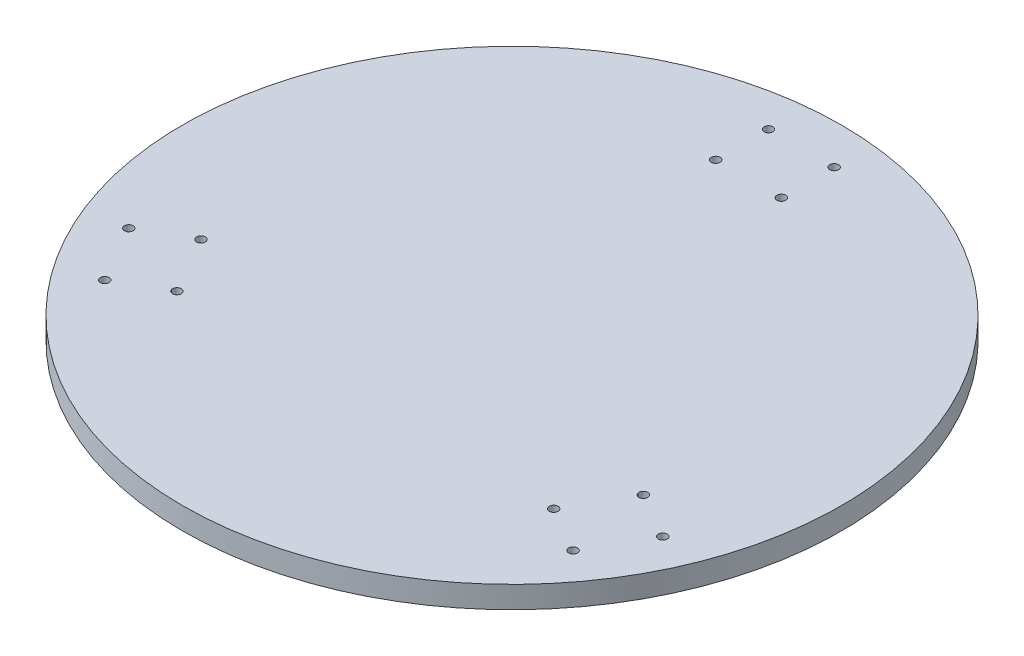
ISO-10303-21;
HEADER;
FILE_DESCRIPTION(('STEP AP214'),'2;1');
FILE_NAME('part.step','',(''),(''),'','','');
FILE_SCHEMA(('AUTOMOTIVE_DESIGN { 1 0 10303 214 1 1 1 1 }'));
ENDSEC;
DATA;
#1=APPLICATION_CONTEXT('core data for automotive mechanical design processes');
#2=APPLICATION_PROTOCOL_DEFINITION('international standard','automotive_design',2000,#1);
#3=PRODUCT_CONTEXT('',#1,'mechanical');
#4=PRODUCT('Part','Part','',(#3));
#5=PRODUCT_RELATED_PRODUCT_CATEGORY('part','',(#4));
#6=PRODUCT_DEFINITION_FORMATION('','',#4);
#7=PRODUCT_DEFINITION_CONTEXT('part definition',#1,'design');
#8=PRODUCT_DEFINITION('design','',#6,#7);
#9=PRODUCT_DEFINITION_SHAPE('','',#8);
#10=(LENGTH_UNIT() NAMED_UNIT(*) SI_UNIT(.MILLI.,.METRE.));
#11=(NAMED_UNIT(*) PLANE_ANGLE_UNIT() SI_UNIT($,.RADIAN.));
#12=(NAMED_UNIT(*) SI_UNIT($,.STERADIAN.) SOLID_ANGLE_UNIT());
#13=UNCERTAINTY_MEASURE_WITH_UNIT(LENGTH_MEASURE(1.E-05),#10,'distance_accuracy_value','');
#14=(GEOMETRIC_REPRESENTATION_CONTEXT(3) GLOBAL_UNCERTAINTY_ASSIGNED_CONTEXT((#13)) GLOBAL_UNIT_ASSIGNED_CONTEXT((#10,
#11,#12)) REPRESENTATION_CONTEXT('',''));
#15=CARTESIAN_POINT('',(0.,0.,0.));
#16=DIRECTION('',(0.,0.,1.));
#17=DIRECTION('',(1.,0.,0.));
#18=AXIS2_PLACEMENT_3D('',#15,#16,#17);
#19=CARTESIAN_POINT('',(0.,10.,0.));
#20=DIRECTION('',(0.,-1.,0.));
#21=DIRECTION('',(0.,0.,-1.));
#22=AXIS2_PLACEMENT_3D('',#19,#20,#21);
#23=CYLINDRICAL_SURFACE('',#22,150.);
#24=CARTESIAN_POINT('',(0.,10.,0.));
#25=DIRECTION('',(0.,1.,0.));
#26=DIRECTION('',(0.,0.,1.));
#27=AXIS2_PLACEMENT_3D('',#24,#25,#26);
#28=CIRCLE('',#27,150.);
#29=CARTESIAN_POINT('',(0.,10.,150.));
#30=VERTEX_POINT('',#29);
#31=EDGE_CURVE('E10',#30,#30,#28,.T.);
#32=ORIENTED_EDGE('',*,*,#31,.F.);
#33=EDGE_LOOP('',(#32));
#34=FACE_BOUND('',#33,.T.);
#35=CARTESIAN_POINT('',(0.,0.,0.));
#36=DIRECTION('',(0.,1.,0.));
#37=DIRECTION('',(0.,0.,1.));
#38=AXIS2_PLACEMENT_3D('',#35,#36,#37);
#39=CIRCLE('',#38,150.);
#40=CARTESIAN_POINT('',(0.,0.,150.));
#41=VERTEX_POINT('',#40);
#42=EDGE_CURVE('E44',#41,#41,#39,.T.);
#43=ORIENTED_EDGE('',*,*,#42,.T.);
#44=EDGE_LOOP('',(#43));
#45=FACE_BOUND('',#44,.T.);
#46=ADVANCED_FACE('F41',(#34,#45),#23,.T.);
#47=CARTESIAN_POINT('',(0.,10.,0.));
#48=DIRECTION('',(0.,1.,0.));
#49=DIRECTION('',(0.,0.,1.));
#50=AXIS2_PLACEMENT_3D('',#47,#48,#49);
#51=PLANE('',#50);
#52=CARTESIAN_POINT('',(-106.588625041321,10.,78.7959709062652));
#53=DIRECTION('',(0.,1.,0.));
#54=DIRECTION('',(0.,0.,1.));
#55=AXIS2_PLACEMENT_3D('',#52,#53,#54);
#56=CIRCLE('',#55,2.0000000000276);
#57=CARTESIAN_POINT('',(-106.588625041321,10.,80.7959709062928));
#58=VERTEX_POINT('',#57);
#59=EDGE_CURVE('E99',#58,#58,#56,.T.);
#60=ORIENTED_EDGE('',*,*,#59,.F.);
#61=EDGE_LOOP('',(#60));
#62=FACE_BOUND('',#61,.T.);
#63=CARTESIAN_POINT('',(106.588625041366,10.,78.7959709062389));
#64=DIRECTION('',(0.,1.,0.));
#65=DIRECTION('',(0.,0.,-1.));
#66=AXIS2_PLACEMENT_3D('',#63,#64,#65);
#67=CIRCLE('',#66,2.00000000001479);
#68=CARTESIAN_POINT('',(106.588625041366,10.,76.7959709062241));
#69=VERTEX_POINT('',#68);
#70=EDGE_CURVE('E108',#69,#69,#67,.T.);
#71=ORIENTED_EDGE('',*,*,#70,.F.);
#72=EDGE_LOOP('',(#71));
#73=FACE_BOUND('',#72,.T.);
#74=CARTESIAN_POINT('',(85.7520538263128,10.,66.7659709062389));
#75=DIRECTION('',(0.,1.,0.));
#76=DIRECTION('',(0.,0.,-1.));
#77=AXIS2_PLACEMENT_3D('',#74,#75,#76);
#78=CIRCLE('',#77,2.00000000001484);
#79=CARTESIAN_POINT('',(85.7520538263128,10.,64.7659709062241));
#80=VERTEX_POINT('',#79);
#81=EDGE_CURVE('E116',#80,#80,#78,.T.);
#82=ORIENTED_EDGE('',*,*,#81,.F.);
#83=EDGE_LOOP('',(#82));
#84=FACE_BOUND('',#83,.T.);
#85=CARTESIAN_POINT('',(100.697053826313,10.,40.880471587122));
#86=DIRECTION('',(0.,1.,0.));
#87=DIRECTION('',(0.,0.,1.));
#88=AXIS2_PLACEMENT_3D('',#85,#86,#87);
#89=CIRCLE('',#88,2.00000000001555);
#90=CARTESIAN_POINT('',(100.697053826313,10.,42.8804715871376));
#91=VERTEX_POINT('',#90);
#92=EDGE_CURVE('E84',#91,#91,#89,.T.);
#93=ORIENTED_EDGE('',*,*,#92,.F.);
#94=EDGE_LOOP('',(#93));
#95=FACE_BOUND('',#94,.T.);
#96=CARTESIAN_POINT('',(-14.945,10.,-107.646442493381));
#97=DIRECTION('',(0.,1.,0.));
#98=DIRECTION('',(0.,0.,1.));
#99=AXIS2_PLACEMENT_3D('',#96,#97,#98);
#100=CIRCLE('',#99,2.);
#101=CARTESIAN_POINT('',(-14.945,10.,-105.646442493381));
#102=VERTEX_POINT('',#101);
#103=EDGE_CURVE('E59',#102,#102,#100,.T.);
#104=ORIENTED_EDGE('',*,*,#103,.F.);
#105=EDGE_LOOP('',(#104));
#106=FACE_BOUND('',#105,.T.);
#107=CARTESIAN_POINT('',(14.9449999999993,10.,-107.646442493381));
#108=DIRECTION('',(0.,1.,0.));
#109=DIRECTION('',(0.,0.,-1.));
#110=AXIS2_PLACEMENT_3D('',#107,#108,#109);
#111=CIRCLE('',#110,2.);
#112=CARTESIAN_POINT('',(14.9449999999993,10.,-109.646442493381));
#113=VERTEX_POINT('',#112);
#114=EDGE_CURVE('E67',#113,#113,#111,.T.);
#115=ORIENTED_EDGE('',*,*,#114,.F.);
#116=EDGE_LOOP('',(#115));
#117=FACE_BOUND('',#116,.T.);
#118=CARTESIAN_POINT('',(14.9449999999991,10.,-131.706442493381));
#119=DIRECTION('',(0.,1.,0.));
#120=DIRECTION('',(0.,0.,-1.));
#121=AXIS2_PLACEMENT_3D('',#118,#119,#120);
#122=CIRCLE('',#121,2.);
#123=CARTESIAN_POINT('',(14.9449999999991,10.,-133.706442493381));
#124=VERTEX_POINT('',#123);
#125=EDGE_CURVE('E68',#124,#124,#122,.T.);
#126=ORIENTED_EDGE('',*,*,#125,.F.);
#127=EDGE_LOOP('',(#126));
#128=FACE_BOUND('',#127,.T.);
#129=CARTESIAN_POINT('',(121.533625041366,10.,52.910471587122));
#130=DIRECTION('',(0.,1.,0.));
#131=DIRECTION('',(0.,0.,1.));
#132=AXIS2_PLACEMENT_3D('',#129,#130,#131);
#133=CIRCLE('',#132,2.00000000001566);
#134=CARTESIAN_POINT('',(121.533625041366,10.,54.9104715871377));
#135=VERTEX_POINT('',#134);
#136=EDGE_CURVE('E83',#135,#135,#133,.T.);
#137=ORIENTED_EDGE('',*,*,#136,.F.);
#138=EDGE_LOOP('',(#137));
#139=FACE_BOUND('',#138,.T.);
#140=CARTESIAN_POINT('',(-85.7520538262674,10.,66.7659709062652));
#141=DIRECTION('',(0.,1.,0.));
#142=DIRECTION('',(0.,0.,1.));
#143=AXIS2_PLACEMENT_3D('',#140,#141,#142);
#144=CIRCLE('',#143,2.00000000002738);
#145=CARTESIAN_POINT('',(-85.7520538262674,10.,68.7659709062925));
#146=VERTEX_POINT('',#145);
#147=EDGE_CURVE('E100',#146,#146,#144,.T.);
#148=ORIENTED_EDGE('',*,*,#147,.F.);
#149=EDGE_LOOP('',(#148));
#150=FACE_BOUND('',#149,.T.);
#151=CARTESIAN_POINT('',(-100.697053826267,10.,40.8804715871483));
#152=DIRECTION('',(0.,1.,0.));
#153=DIRECTION('',(0.,0.,-1.));
#154=AXIS2_PLACEMENT_3D('',#151,#152,#153);
#155=CIRCLE('',#154,2.0000000000266);
#156=CARTESIAN_POINT('',(-100.697053826267,10.,38.8804715871217));
#157=VERTEX_POINT('',#156);
#158=EDGE_CURVE('E139',#157,#157,#155,.T.);
#159=ORIENTED_EDGE('',*,*,#158,.F.);
#160=EDGE_LOOP('',(#159));
#161=FACE_BOUND('',#160,.T.);
#162=CARTESIAN_POINT('',(-121.533625041321,10.,52.9104715871483));
#163=DIRECTION('',(0.,1.,0.));
#164=DIRECTION('',(0.,0.,-1.));
#165=AXIS2_PLACEMENT_3D('',#162,#163,#164);
#166=CIRCLE('',#165,2.00000000002669);
#167=CARTESIAN_POINT('',(-121.533625041321,10.,50.9104715871216));
#168=VERTEX_POINT('',#167);
#169=EDGE_CURVE('E131',#168,#168,#166,.T.);
#170=ORIENTED_EDGE('',*,*,#169,.F.);
#171=EDGE_LOOP('',(#170));
#172=FACE_BOUND('',#171,.T.);
#173=CARTESIAN_POINT('',(-14.945,10.,-131.706442493381));
#174=DIRECTION('',(0.,1.,0.));
#175=DIRECTION('',(0.,0.,1.));
#176=AXIS2_PLACEMENT_3D('',#173,#174,#175);
#177=CIRCLE('',#176,2.);
#178=CARTESIAN_POINT('',(-14.945,10.,-129.706442493381));
#179=VERTEX_POINT('',#178);
#180=EDGE_CURVE('E55',#179,#179,#177,.T.);
#181=ORIENTED_EDGE('',*,*,#180,.F.);
#182=EDGE_LOOP('',(#181));
#183=FACE_BOUND('',#182,.T.);
#184=ORIENTED_EDGE('',*,*,#31,.T.);
#185=EDGE_LOOP('',(#184));
#186=FACE_BOUND('',#185,.T.);
#187=ADVANCED_FACE('F153',(#62,#73,#84,#95,#106,#117,#128,#139,#150,#161,#172,#183,#186),#51,.T.);
#188=CARTESIAN_POINT('',(0.,0.,0.));
#189=DIRECTION('',(0.,1.,0.));
#190=DIRECTION('',(0.,0.,1.));
#191=AXIS2_PLACEMENT_3D('',#188,#189,#190);
#192=PLANE('',#191);
#193=CARTESIAN_POINT('',(-106.588625041321,0.,78.7959709062652));
#194=DIRECTION('',(0.,1.,0.));
#195=DIRECTION('',(0.,0.,1.));
#196=AXIS2_PLACEMENT_3D('',#193,#194,#195);
#197=CIRCLE('',#196,2.0000000000276);
#198=CARTESIAN_POINT('',(-106.588625041321,0.,80.7959709062928));
#199=VERTEX_POINT('',#198);
#200=EDGE_CURVE('E95',#199,#199,#197,.T.);
#201=ORIENTED_EDGE('',*,*,#200,.T.);
#202=EDGE_LOOP('',(#201));
#203=FACE_BOUND('',#202,.T.);
#204=CARTESIAN_POINT('',(106.588625041366,0.,78.7959709062389));
#205=DIRECTION('',(0.,1.,0.));
#206=DIRECTION('',(0.,0.,-1.));
#207=AXIS2_PLACEMENT_3D('',#204,#205,#206);
#208=CIRCLE('',#207,2.00000000001479);
#209=CARTESIAN_POINT('',(106.588625041366,0.,76.7959709062241));
#210=VERTEX_POINT('',#209);
#211=EDGE_CURVE('E104',#210,#210,#208,.T.);
#212=ORIENTED_EDGE('',*,*,#211,.T.);
#213=EDGE_LOOP('',(#212));
#214=FACE_BOUND('',#213,.T.);
#215=CARTESIAN_POINT('',(85.7520538263128,0.,66.7659709062389));
#216=DIRECTION('',(0.,1.,0.));
#217=DIRECTION('',(0.,0.,-1.));
#218=AXIS2_PLACEMENT_3D('',#215,#216,#217);
#219=CIRCLE('',#218,2.00000000001484);
#220=CARTESIAN_POINT('',(85.7520538263128,0.,64.7659709062241));
#221=VERTEX_POINT('',#220);
#222=EDGE_CURVE('E112',#221,#221,#219,.T.);
#223=ORIENTED_EDGE('',*,*,#222,.T.);
#224=EDGE_LOOP('',(#223));
#225=FACE_BOUND('',#224,.T.);
#226=CARTESIAN_POINT('',(100.697053826313,0.,40.880471587122));
#227=DIRECTION('',(0.,1.,0.));
#228=DIRECTION('',(0.,0.,1.));
#229=AXIS2_PLACEMENT_3D('',#226,#227,#228);
#230=CIRCLE('',#229,2.00000000001555);
#231=CARTESIAN_POINT('',(100.697053826313,0.,42.8804715871376));
#232=VERTEX_POINT('',#231);
#233=EDGE_CURVE('E120',#232,#232,#230,.T.);
#234=ORIENTED_EDGE('',*,*,#233,.T.);
#235=EDGE_LOOP('',(#234));
#236=FACE_BOUND('',#235,.T.);
#237=CARTESIAN_POINT('',(-14.945,0.,-107.646442493381));
#238=DIRECTION('',(0.,1.,0.));
#239=DIRECTION('',(0.,0.,1.));
#240=AXIS2_PLACEMENT_3D('',#237,#238,#239);
#241=CIRCLE('',#240,2.);
#242=CARTESIAN_POINT('',(-14.945,0.,-105.646442493381));
#243=VERTEX_POINT('',#242);
#244=EDGE_CURVE('E72',#243,#243,#241,.T.);
#245=ORIENTED_EDGE('',*,*,#244,.T.);
#246=EDGE_LOOP('',(#245));
#247=FACE_BOUND('',#246,.T.);
#248=CARTESIAN_POINT('',(14.9449999999993,0.,-107.646442493381));
#249=DIRECTION('',(0.,1.,0.));
#250=DIRECTION('',(0.,0.,-1.));
#251=AXIS2_PLACEMENT_3D('',#248,#249,#250);
#252=CIRCLE('',#251,2.);
#253=CARTESIAN_POINT('',(14.9449999999993,0.,-109.646442493381));
#254=VERTEX_POINT('',#253);
#255=EDGE_CURVE('E63',#254,#254,#252,.T.);
#256=ORIENTED_EDGE('',*,*,#255,.T.);
#257=EDGE_LOOP('',(#256));
#258=FACE_BOUND('',#257,.T.);
#259=CARTESIAN_POINT('',(14.9449999999991,0.,-131.706442493381));
#260=DIRECTION('',(0.,1.,0.));
#261=DIRECTION('',(0.,0.,-1.));
#262=AXIS2_PLACEMENT_3D('',#259,#260,#261);
#263=CIRCLE('',#262,2.);
#264=CARTESIAN_POINT('',(14.9449999999991,0.,-133.706442493381));
#265=VERTEX_POINT('',#264);
#266=EDGE_CURVE('E88',#265,#265,#263,.T.);
#267=ORIENTED_EDGE('',*,*,#266,.T.);
#268=EDGE_LOOP('',(#267));
#269=FACE_BOUND('',#268,.T.);
#270=CARTESIAN_POINT('',(121.533625041366,0.,52.910471587122));
#271=DIRECTION('',(0.,1.,0.));
#272=DIRECTION('',(0.,0.,1.));
#273=AXIS2_PLACEMENT_3D('',#270,#271,#272);
#274=CIRCLE('',#273,2.00000000001566);
#275=CARTESIAN_POINT('',(121.533625041366,0.,54.9104715871377));
#276=VERTEX_POINT('',#275);
#277=EDGE_CURVE('E79',#276,#276,#274,.T.);
#278=ORIENTED_EDGE('',*,*,#277,.T.);
#279=EDGE_LOOP('',(#278));
#280=FACE_BOUND('',#279,.T.);
#281=CARTESIAN_POINT('',(-85.7520538262674,0.,66.7659709062652));
#282=DIRECTION('',(0.,1.,0.));
#283=DIRECTION('',(0.,0.,1.));
#284=AXIS2_PLACEMENT_3D('',#281,#282,#283);
#285=CIRCLE('',#284,2.00000000002738);
#286=CARTESIAN_POINT('',(-85.7520538262674,0.,68.7659709062925));
#287=VERTEX_POINT('',#286);
#288=EDGE_CURVE('E143',#287,#287,#285,.T.);
#289=ORIENTED_EDGE('',*,*,#288,.T.);
#290=EDGE_LOOP('',(#289));
#291=FACE_BOUND('',#290,.T.);
#292=CARTESIAN_POINT('',(-100.697053826267,0.,40.8804715871483));
#293=DIRECTION('',(0.,1.,0.));
#294=DIRECTION('',(0.,0.,-1.));
#295=AXIS2_PLACEMENT_3D('',#292,#293,#294);
#296=CIRCLE('',#295,2.0000000000266);
#297=CARTESIAN_POINT('',(-100.697053826267,0.,38.8804715871217));
#298=VERTEX_POINT('',#297);
#299=EDGE_CURVE('E135',#298,#298,#296,.T.);
#300=ORIENTED_EDGE('',*,*,#299,.T.);
#301=EDGE_LOOP('',(#300));
#302=FACE_BOUND('',#301,.T.);
#303=CARTESIAN_POINT('',(-121.533625041321,0.,52.9104715871483));
#304=DIRECTION('',(0.,1.,0.));
#305=DIRECTION('',(0.,0.,-1.));
#306=AXIS2_PLACEMENT_3D('',#303,#304,#305);
#307=CIRCLE('',#306,2.00000000002669);
#308=CARTESIAN_POINT('',(-121.533625041321,0.,50.9104715871216));
#309=VERTEX_POINT('',#308);
#310=EDGE_CURVE('E127',#309,#309,#307,.T.);
#311=ORIENTED_EDGE('',*,*,#310,.T.);
#312=EDGE_LOOP('',(#311));
#313=FACE_BOUND('',#312,.T.);
#314=CARTESIAN_POINT('',(-14.945,0.,-131.706442493381));
#315=DIRECTION('',(0.,1.,0.));
#316=DIRECTION('',(0.,0.,1.));
#317=AXIS2_PLACEMENT_3D('',#314,#315,#316);
#318=CIRCLE('',#317,2.);
#319=CARTESIAN_POINT('',(-14.945,0.,-129.706442493381));
#320=VERTEX_POINT('',#319);
#321=EDGE_CURVE('E53',#320,#320,#318,.T.);
#322=ORIENTED_EDGE('',*,*,#321,.T.);
#323=EDGE_LOOP('',(#322));
#324=FACE_BOUND('',#323,.T.);
#325=ORIENTED_EDGE('',*,*,#42,.F.);
#326=EDGE_LOOP('',(#325));
#327=FACE_BOUND('',#326,.T.);
#328=ADVANCED_FACE('F156',(#203,#214,#225,#236,#247,#258,#269,#280,#291,#302,#313,#324,#327),
#192,.F.);
#329=CARTESIAN_POINT('',(-14.945,0.,-131.706442493381));
#330=DIRECTION('',(0.,1.,0.));
#331=DIRECTION('',(0.,0.,1.));
#332=AXIS2_PLACEMENT_3D('',#329,#330,#331);
#333=CYLINDRICAL_SURFACE('',#332,2.);
#334=ORIENTED_EDGE('',*,*,#321,.F.);
#335=EDGE_LOOP('',(#334));
#336=FACE_BOUND('',#335,.T.);
#337=ORIENTED_EDGE('',*,*,#180,.T.);
#338=EDGE_LOOP('',(#337));
#339=FACE_BOUND('',#338,.T.);
#340=ADVANCED_FACE('F165',(#336,#339),#333,.F.);
#341=CARTESIAN_POINT('',(-121.533625041321,0.,52.9104715871483));
#342=DIRECTION('',(0.,1.,0.));
#343=DIRECTION('',(0.,0.,1.));
#344=AXIS2_PLACEMENT_3D('',#341,#342,#343);
#345=CYLINDRICAL_SURFACE('',#344,2.00000000002669);
#346=ORIENTED_EDGE('',*,*,#310,.F.);
#347=EDGE_LOOP('',(#346));
#348=FACE_BOUND('',#347,.T.);
#349=ORIENTED_EDGE('',*,*,#169,.T.);
#350=EDGE_LOOP('',(#349));
#351=FACE_BOUND('',#350,.T.);
#352=ADVANCED_FACE('F167',(#348,#351),#345,.F.);
#353=CARTESIAN_POINT('',(-100.697053826267,0.,40.8804715871483));
#354=DIRECTION('',(0.,1.,0.));
#355=DIRECTION('',(0.,0.,1.));
#356=AXIS2_PLACEMENT_3D('',#353,#354,#355);
#357=CYLINDRICAL_SURFACE('',#356,2.0000000000266);
#358=ORIENTED_EDGE('',*,*,#299,.F.);
#359=EDGE_LOOP('',(#358));
#360=FACE_BOUND('',#359,.T.);
#361=ORIENTED_EDGE('',*,*,#158,.T.);
#362=EDGE_LOOP('',(#361));
#363=FACE_BOUND('',#362,.T.);
#364=ADVANCED_FACE('F174',(#360,#363),#357,.F.);
#365=CARTESIAN_POINT('',(-85.7520538262674,0.,66.7659709062652));
#366=DIRECTION('',(0.,1.,0.));
#367=DIRECTION('',(0.,0.,1.));
#368=AXIS2_PLACEMENT_3D('',#365,#366,#367);
#369=CYLINDRICAL_SURFACE('',#368,2.00000000002738);
#370=ORIENTED_EDGE('',*,*,#288,.F.);
#371=EDGE_LOOP('',(#370));
#372=FACE_BOUND('',#371,.T.);
#373=ORIENTED_EDGE('',*,*,#147,.T.);
#374=EDGE_LOOP('',(#373));
#375=FACE_BOUND('',#374,.T.);
#376=ADVANCED_FACE('F151',(#372,#375),#369,.F.);
#377=CARTESIAN_POINT('',(121.533625041366,0.,52.910471587122));
#378=DIRECTION('',(0.,1.,0.));
#379=DIRECTION('',(0.,0.,1.));
#380=AXIS2_PLACEMENT_3D('',#377,#378,#379);
#381=CYLINDRICAL_SURFACE('',#380,2.00000000001566);
#382=ORIENTED_EDGE('',*,*,#277,.F.);
#383=EDGE_LOOP('',(#382));
#384=FACE_BOUND('',#383,.T.);
#385=ORIENTED_EDGE('',*,*,#136,.T.);
#386=EDGE_LOOP('',(#385));
#387=FACE_BOUND('',#386,.T.);
#388=ADVANCED_FACE('F227',(#384,#387),#381,.F.);
#389=CARTESIAN_POINT('',(14.9449999999991,0.,-131.706442493381));
#390=DIRECTION('',(0.,1.,0.));
#391=DIRECTION('',(0.,0.,1.));
#392=AXIS2_PLACEMENT_3D('',#389,#390,#391);
#393=CYLINDRICAL_SURFACE('',#392,2.);
#394=ORIENTED_EDGE('',*,*,#266,.F.);
#395=EDGE_LOOP('',(#394));
#396=FACE_BOUND('',#395,.T.);
#397=ORIENTED_EDGE('',*,*,#125,.T.);
#398=EDGE_LOOP('',(#397));
#399=FACE_BOUND('',#398,.T.);
#400=ADVANCED_FACE('F238',(#396,#399),#393,.F.);
#401=CARTESIAN_POINT('',(14.9449999999993,0.,-107.646442493381));
#402=DIRECTION('',(0.,1.,0.));
#403=DIRECTION('',(0.,0.,1.));
#404=AXIS2_PLACEMENT_3D('',#401,#402,#403);
#405=CYLINDRICAL_SURFACE('',#404,2.);
#406=ORIENTED_EDGE('',*,*,#255,.F.);
#407=EDGE_LOOP('',(#406));
#408=FACE_BOUND('',#407,.T.);
#409=ORIENTED_EDGE('',*,*,#114,.T.);
#410=EDGE_LOOP('',(#409));
#411=FACE_BOUND('',#410,.T.);
#412=ADVANCED_FACE('F249',(#408,#411),#405,.F.);
#413=CARTESIAN_POINT('',(-14.945,0.,-107.646442493381));
#414=DIRECTION('',(0.,1.,0.));
#415=DIRECTION('',(0.,0.,1.));
#416=AXIS2_PLACEMENT_3D('',#413,#414,#415);
#417=CYLINDRICAL_SURFACE('',#416,2.);
#418=ORIENTED_EDGE('',*,*,#244,.F.);
#419=EDGE_LOOP('',(#418));
#420=FACE_BOUND('',#419,.T.);
#421=ORIENTED_EDGE('',*,*,#103,.T.);
#422=EDGE_LOOP('',(#421));
#423=FACE_BOUND('',#422,.T.);
#424=ADVANCED_FACE('F260',(#420,#423),#417,.F.);
#425=CARTESIAN_POINT('',(100.697053826313,0.,40.880471587122));
#426=DIRECTION('',(0.,1.,0.));
#427=DIRECTION('',(0.,0.,1.));
#428=AXIS2_PLACEMENT_3D('',#425,#426,#427);
#429=CYLINDRICAL_SURFACE('',#428,2.00000000001555);
#430=ORIENTED_EDGE('',*,*,#233,.F.);
#431=EDGE_LOOP('',(#430));
#432=FACE_BOUND('',#431,.T.);
#433=ORIENTED_EDGE('',*,*,#92,.T.);
#434=EDGE_LOOP('',(#433));
#435=FACE_BOUND('',#434,.T.);
#436=ADVANCED_FACE('F270',(#432,#435),#429,.F.);
#437=CARTESIAN_POINT('',(85.7520538263128,0.,66.7659709062389));
#438=DIRECTION('',(0.,1.,0.));
#439=DIRECTION('',(0.,0.,1.));
#440=AXIS2_PLACEMENT_3D('',#437,#438,#439);
#441=CYLINDRICAL_SURFACE('',#440,2.00000000001484);
#442=ORIENTED_EDGE('',*,*,#222,.F.);
#443=EDGE_LOOP('',(#442));
#444=FACE_BOUND('',#443,.T.);
#445=ORIENTED_EDGE('',*,*,#81,.T.);
#446=EDGE_LOOP('',(#445));
#447=FACE_BOUND('',#446,.T.);
#448=ADVANCED_FACE('F281',(#444,#447),#441,.F.);
#449=CARTESIAN_POINT('',(106.588625041366,0.,78.7959709062389));
#450=DIRECTION('',(0.,1.,0.));
#451=DIRECTION('',(0.,0.,1.));
#452=AXIS2_PLACEMENT_3D('',#449,#450,#451);
#453=CYLINDRICAL_SURFACE('',#452,2.00000000001479);
#454=ORIENTED_EDGE('',*,*,#211,.F.);
#455=EDGE_LOOP('',(#454));
#456=FACE_BOUND('',#455,.T.);
#457=ORIENTED_EDGE('',*,*,#70,.T.);
#458=EDGE_LOOP('',(#457));
#459=FACE_BOUND('',#458,.T.);
#460=ADVANCED_FACE('F292',(#456,#459),#453,.F.);
#461=CARTESIAN_POINT('',(-106.588625041321,0.,78.7959709062652));
#462=DIRECTION('',(0.,1.,0.));
#463=DIRECTION('',(0.,0.,1.));
#464=AXIS2_PLACEMENT_3D('',#461,#462,#463);
#465=CYLINDRICAL_SURFACE('',#464,2.0000000000276);
#466=ORIENTED_EDGE('',*,*,#200,.F.);
#467=EDGE_LOOP('',(#466));
#468=FACE_BOUND('',#467,.T.);
#469=ORIENTED_EDGE('',*,*,#59,.T.);
#470=EDGE_LOOP('',(#469));
#471=FACE_BOUND('',#470,.T.);
#472=ADVANCED_FACE('F303',(#468,#471),#465,.F.);
#473=CLOSED_SHELL('',(#46,#187,#328,#340,#352,#364,#376,#388,#400,#412,#424,#436,#448,#460,#472));
#474=MANIFOLD_SOLID_BREP('B2',#473);
#475=ADVANCED_BREP_SHAPE_REPRESENTATION('',(#18,#474),#14);
#476=SHAPE_DEFINITION_REPRESENTATION(#9,#475);
ENDSEC;
END-ISO-10303-21;
